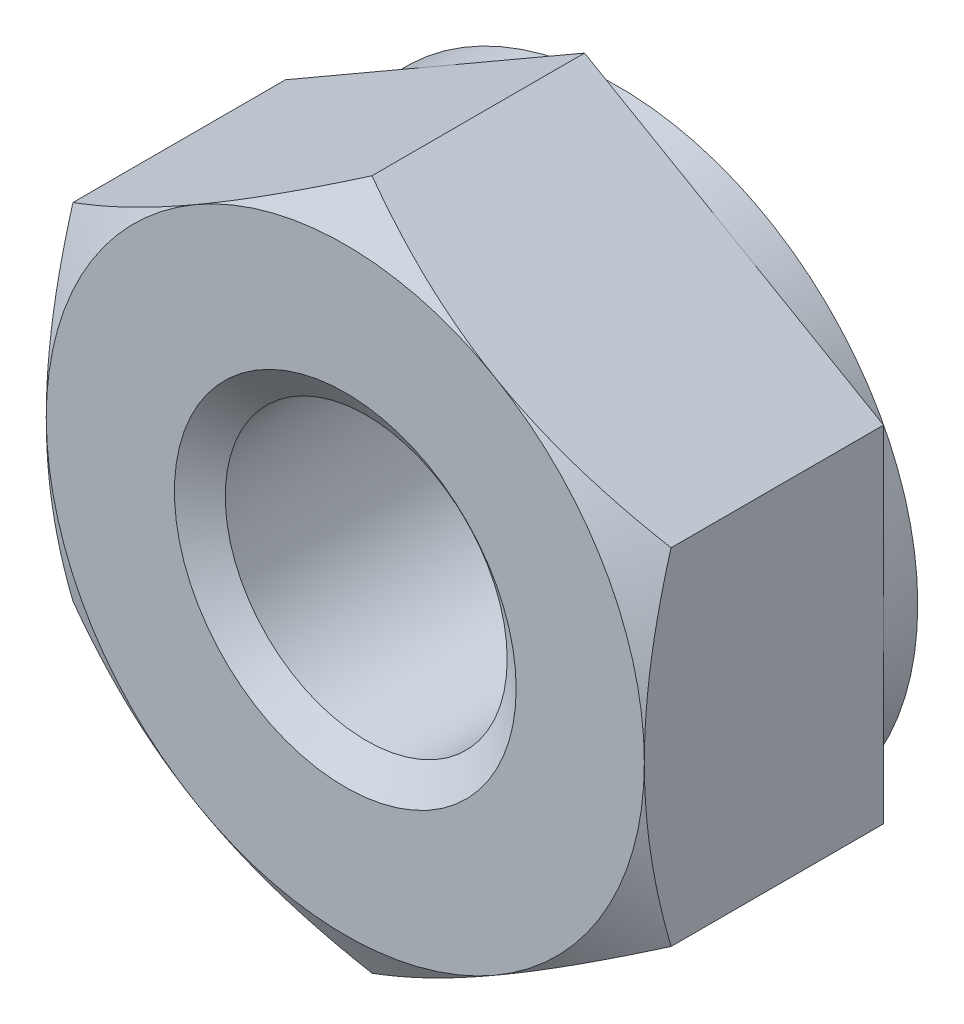
ISO-10303-21;
HEADER;
FILE_DESCRIPTION(('STEP AP214'),'2;1');
FILE_NAME('part.step','',(''),(''),'','','');
FILE_SCHEMA(('AUTOMOTIVE_DESIGN { 1 0 10303 214 1 1 1 1 }'));
ENDSEC;
DATA;
#1=APPLICATION_CONTEXT('core data for automotive mechanical design processes');
#2=APPLICATION_PROTOCOL_DEFINITION('international standard','automotive_design',2000,#1);
#3=PRODUCT_CONTEXT('',#1,'mechanical');
#4=PRODUCT('Part','Part','',(#3));
#5=PRODUCT_RELATED_PRODUCT_CATEGORY('part','',(#4));
#6=PRODUCT_DEFINITION_FORMATION('','',#4);
#7=PRODUCT_DEFINITION_CONTEXT('part definition',#1,'design');
#8=PRODUCT_DEFINITION('design','',#6,#7);
#9=PRODUCT_DEFINITION_SHAPE('','',#8);
#10=(LENGTH_UNIT() NAMED_UNIT(*) SI_UNIT(.MILLI.,.METRE.));
#11=(NAMED_UNIT(*) PLANE_ANGLE_UNIT() SI_UNIT($,.RADIAN.));
#12=(NAMED_UNIT(*) SI_UNIT($,.STERADIAN.) SOLID_ANGLE_UNIT());
#13=UNCERTAINTY_MEASURE_WITH_UNIT(LENGTH_MEASURE(1.E-05),#10,'distance_accuracy_value','');
#14=(GEOMETRIC_REPRESENTATION_CONTEXT(3) GLOBAL_UNCERTAINTY_ASSIGNED_CONTEXT((#13)) GLOBAL_UNIT_ASSIGNED_CONTEXT((#10,
#11,#12)) REPRESENTATION_CONTEXT('',''));
#15=CARTESIAN_POINT('',(0.,0.,0.));
#16=DIRECTION('',(0.,0.,1.));
#17=DIRECTION('',(1.,0.,0.));
#18=AXIS2_PLACEMENT_3D('',#15,#16,#17);
#19=CARTESIAN_POINT('',(0.,0.,-3.2));
#20=DIRECTION('',(0.,0.,1.));
#21=DIRECTION('',(1.,0.,0.));
#22=AXIS2_PLACEMENT_3D('',#19,#20,#21);
#23=CYLINDRICAL_SURFACE('',#22,1.65);
#24=CARTESIAN_POINT('',(0.,0.,-0.245072638373399));
#25=DIRECTION('',(0.,0.,1.));
#26=DIRECTION('',(1.,0.,0.));
#27=AXIS2_PLACEMENT_3D('',#24,#25,#26);
#28=CIRCLE('',#27,1.65);
#29=CARTESIAN_POINT('',(1.65,0.,-0.245072638373399));
#30=VERTEX_POINT('',#29);
#31=EDGE_CURVE('E153',#30,#30,#28,.F.);
#32=ORIENTED_EDGE('',*,*,#31,.F.);
#33=EDGE_LOOP('',(#32));
#34=FACE_BOUND('',#33,.T.);
#35=CARTESIAN_POINT('',(0.,0.,-2.9295273616266));
#36=DIRECTION('',(0.,0.,-1.));
#37=DIRECTION('',(-1.,0.,0.));
#38=AXIS2_PLACEMENT_3D('',#35,#36,#37);
#39=CIRCLE('',#38,1.65);
#40=CARTESIAN_POINT('',(-1.65,0.,-2.9295273616266));
#41=VERTEX_POINT('',#40);
#42=EDGE_CURVE('E41',#41,#41,#39,.F.);
#43=ORIENTED_EDGE('',*,*,#42,.F.);
#44=EDGE_LOOP('',(#43));
#45=FACE_BOUND('',#44,.T.);
#46=ADVANCED_FACE('F36',(#34,#45),#23,.F.);
#47=CARTESIAN_POINT('',(0.,4.04145188432738,-3.2));
#48=DIRECTION('',(-0.500000000000001,0.866025403784438,0.));
#49=DIRECTION('',(-0.866025403784438,-0.500000000000001,0.));
#50=AXIS2_PLACEMENT_3D('',#47,#48,#49);
#51=PLANE('',#50);
#52=DIRECTION('',(0.,0.,1.));
#53=VECTOR('',#52,1.);
#54=CARTESIAN_POINT('',(-3.5,2.02072594216369,-3.2));
#55=LINE('',#54,#53);
#56=CARTESIAN_POINT('',(-3.5,2.02072594216369,-2.8));
#57=VERTEX_POINT('',#56);
#58=CARTESIAN_POINT('',(-3.5,2.02072594216369,-0.312607391169646));
#59=VERTEX_POINT('',#58);
#60=EDGE_CURVE('E288',#57,#59,#55,.T.);
#61=ORIENTED_EDGE('',*,*,#60,.T.);
#62=CARTESIAN_POINT('',(-3.5002,2.02061047210985,-0.312674060693372));
#63=CARTESIAN_POINT('',(-3.34639282154755,2.10941108799267,-0.261385788989984));
#64=CARTESIAN_POINT('',(-3.19125798916558,2.19897822522909,-0.214740953816197));
#65=CARTESIAN_POINT('',(-2.87830199342322,2.37966345361545,-0.133321875533349));
#66=CARTESIAN_POINT('',(-2.7204752692125,2.47078475532382,-0.0985764355845612));
#67=CARTESIAN_POINT('',(-2.40677778961987,2.65189807961073,-0.0444900271828357));
#68=CARTESIAN_POINT('',(-2.25095530083931,2.74186223545399,-0.0247890862603812));
#69=CARTESIAN_POINT('',(-1.93857711279463,2.92221386641056,-0.00127013273725415));
#70=CARTESIAN_POINT('',(-1.78202254896577,3.01260068598001,0.00256735545443494));
#71=CARTESIAN_POINT('',(-1.48949078007901,3.1814939814933,-0.00541530187697763));
#72=CARTESIAN_POINT('',(-1.35346978754209,3.26002573814993,-0.0152754340696072));
#73=CARTESIAN_POINT('',(-1.08231397971101,3.41657761679354,-0.046526466899404));
#74=CARTESIAN_POINT('',(-0.947180102315317,3.49459719728458,-0.0679280432857989));
#75=CARTESIAN_POINT('',(-0.675465207594816,3.65147186489429,-0.121430407880578));
#76=CARTESIAN_POINT('',(-0.538918580721664,3.73030709667644,-0.153757994445088));
#77=CARTESIAN_POINT('',(-0.267861907055498,3.88680174018324,-0.227128933807996));
#78=CARTESIAN_POINT('',(-0.133348387531463,3.96446315689009,-0.268155046569869));
#79=CARTESIAN_POINT('',(0.000200000000000957,4.04156735438122,-0.312674060693374));
#80=B_SPLINE_CURVE_WITH_KNOTS('',3,(#62,#63,#64,#65,#66,#67,#68,#69,#70,#71,#72,#73,#74,#75,#76,
#77,#78,#79),.UNSPECIFIED.,.F.,.F.,(4,2,2,2,2,2,2,2,4),(0.,0.554793832886254,1.11092123814984,
1.65328467083219,2.19498204478403,2.6666513085086,3.13875761298267,3.6213361260051,
4.10296698719187),.UNSPECIFIED.);
#81=CARTESIAN_POINT('',(-1.75,3.03108891324553,0.));
#82=VERTEX_POINT('',#81);
#83=EDGE_CURVE('E60',#59,#82,#80,.T.);
#84=ORIENTED_EDGE('',*,*,#83,.T.);
#85=CARTESIAN_POINT('',(0.,4.04145188432738,-0.312607391169646));
#86=VERTEX_POINT('',#85);
#87=EDGE_CURVE('E167',#82,#86,#80,.T.);
#88=ORIENTED_EDGE('',*,*,#87,.T.);
#89=DIRECTION('',(0.,0.,1.));
#90=VECTOR('',#89,1.);
#91=CARTESIAN_POINT('',(0.,4.04145188432738,-3.2));
#92=LINE('',#91,#90);
#93=CARTESIAN_POINT('',(0.,4.04145188432738,-2.8));
#94=VERTEX_POINT('',#93);
#95=EDGE_CURVE('E276',#94,#86,#92,.T.);
#96=ORIENTED_EDGE('',*,*,#95,.F.);
#97=DIRECTION('',(-0.866025403784438,-0.500000000000001,0.));
#98=VECTOR('',#97,1.);
#99=CARTESIAN_POINT('',(0.,4.04145188432738,-2.8));
#100=LINE('',#99,#98);
#101=CARTESIAN_POINT('',(-1.75,3.03108891324553,-2.8));
#102=VERTEX_POINT('',#101);
#103=EDGE_CURVE('E264',#94,#102,#100,.T.);
#104=ORIENTED_EDGE('',*,*,#103,.T.);
#105=EDGE_CURVE('E260',#102,#57,#100,.T.);
#106=ORIENTED_EDGE('',*,*,#105,.T.);
#107=EDGE_LOOP('',(#61,#84,#88,#96,#104,#106));
#108=FACE_BOUND('',#107,.T.);
#109=ADVANCED_FACE('F38',(#108),#51,.T.);
#110=CARTESIAN_POINT('',(3.5,2.02072594216369,-3.2));
#111=DIRECTION('',(0.500000000000001,0.866025403784438,0.));
#112=DIRECTION('',(-0.866025403784438,0.500000000000001,0.));
#113=AXIS2_PLACEMENT_3D('',#110,#111,#112);
#114=PLANE('',#113);
#115=ORIENTED_EDGE('',*,*,#95,.T.);
#116=CARTESIAN_POINT('',(-0.000199999999999582,4.04156735438122,-0.312674060693374));
#117=CARTESIAN_POINT('',(0.15360717845245,3.9527667384984,-0.261385788989986));
#118=CARTESIAN_POINT('',(0.308742010834424,3.86319960126198,-0.214740953816199));
#119=CARTESIAN_POINT('',(0.621698006576782,3.68251437287562,-0.13332187553335));
#120=CARTESIAN_POINT('',(0.779524730787497,3.59139307116725,-0.0985764355845622));
#121=CARTESIAN_POINT('',(1.09322221038013,3.41027974688034,-0.0444900271828364));
#122=CARTESIAN_POINT('',(1.24904469916069,3.32031559103708,-0.0247890862603816));
#123=CARTESIAN_POINT('',(1.56142288720538,3.13996396008051,-0.00127013273725405));
#124=CARTESIAN_POINT('',(1.71797745103423,3.04957714051106,0.00256735545443515));
#125=CARTESIAN_POINT('',(2.01050921992099,2.88068384499777,-0.00541530187697721));
#126=CARTESIAN_POINT('',(2.14653021245791,2.80215208834114,-0.0152754340696066));
#127=CARTESIAN_POINT('',(2.417686020289,2.64560020969753,-0.0465264668994031));
#128=CARTESIAN_POINT('',(2.55281989768468,2.56758062920649,-0.0679280432857977));
#129=CARTESIAN_POINT('',(2.82453479240518,2.41070596159678,-0.121430407880577));
#130=CARTESIAN_POINT('',(2.96108141927834,2.33187072981463,-0.153757994445087));
#131=CARTESIAN_POINT('',(3.2321380929445,2.17537608630783,-0.227128933807994));
#132=CARTESIAN_POINT('',(3.36665161246854,2.09771466960098,-0.268155046569867));
#133=CARTESIAN_POINT('',(3.5002,2.02061047210985,-0.312674060693371));
#134=B_SPLINE_CURVE_WITH_KNOTS('',3,(#116,#117,#118,#119,#120,#121,#122,#123,#124,#125,#126,
#127,#128,#129,#130,#131,#132,#133),.UNSPECIFIED.,.F.,.F.,(4,2,2,2,2,2,2,2,4),(0.,
0.554793832886254,1.11092123814984,1.65328467083219,2.19498204478403,2.6666513085086,
3.13875761298267,3.6213361260051,4.10296698719187),.UNSPECIFIED.);
#135=CARTESIAN_POINT('',(1.75,3.03108891324553,0.));
#136=VERTEX_POINT('',#135);
#137=EDGE_CURVE('E164',#86,#136,#134,.T.);
#138=ORIENTED_EDGE('',*,*,#137,.T.);
#139=CARTESIAN_POINT('',(3.5,2.02072594216369,-0.312607391169646));
#140=VERTEX_POINT('',#139);
#141=EDGE_CURVE('E147',#136,#140,#134,.T.);
#142=ORIENTED_EDGE('',*,*,#141,.T.);
#143=DIRECTION('',(0.,0.,1.));
#144=VECTOR('',#143,1.);
#145=CARTESIAN_POINT('',(3.5,2.02072594216369,-3.2));
#146=LINE('',#145,#144);
#147=CARTESIAN_POINT('',(3.5,2.02072594216369,-2.8));
#148=VERTEX_POINT('',#147);
#149=EDGE_CURVE('E163',#148,#140,#146,.T.);
#150=ORIENTED_EDGE('',*,*,#149,.F.);
#151=DIRECTION('',(-0.866025403784438,0.500000000000001,0.));
#152=VECTOR('',#151,1.);
#153=CARTESIAN_POINT('',(3.5,2.02072594216369,-2.8));
#154=LINE('',#153,#152);
#155=CARTESIAN_POINT('',(1.75,3.03108891324553,-2.8));
#156=VERTEX_POINT('',#155);
#157=EDGE_CURVE('E272',#148,#156,#154,.T.);
#158=ORIENTED_EDGE('',*,*,#157,.T.);
#159=EDGE_CURVE('E268',#156,#94,#154,.T.);
#160=ORIENTED_EDGE('',*,*,#159,.T.);
#161=EDGE_LOOP('',(#115,#138,#142,#150,#158,#160));
#162=FACE_BOUND('',#161,.T.);
#163=ADVANCED_FACE('F236',(#162),#114,.T.);
#164=CARTESIAN_POINT('',(3.5,2.02072594216369,-3.2));
#165=DIRECTION('',(-1.,0.,0.));
#166=DIRECTION('',(0.,0.,1.));
#167=AXIS2_PLACEMENT_3D('',#164,#165,#166);
#168=PLANE('',#167);
#169=CARTESIAN_POINT('',(3.5,-5.35926299121406,-1.67484346858556));
#170=CARTESIAN_POINT('',(3.5,-5.20559319908842,-1.60058173692104));
#171=CARTESIAN_POINT('',(3.5,-5.05156008083376,-1.52705822833148));
#172=CARTESIAN_POINT('',(3.5,-4.7425707418071,-1.38190950344752));
#173=CARTESIAN_POINT('',(3.5,-4.58761436682437,-1.31028461582133));
#174=CARTESIAN_POINT('',(3.5,-4.27574500225542,-1.16897765517624));
#175=CARTESIAN_POINT('',(3.5,-4.11882589028192,-1.09930904568016));
#176=CARTESIAN_POINT('',(3.5,-3.80369792903856,-0.962964262242763));
#177=CARTESIAN_POINT('',(3.5,-3.64548914750596,-0.896287932319521));
#178=CARTESIAN_POINT('',(3.5,-3.32556618401855,-0.765931819095069));
#179=CARTESIAN_POINT('',(3.5,-3.16383281219924,-0.702298873688867));
#180=CARTESIAN_POINT('',(3.5,-2.83845840945598,-0.580016702089494));
#181=CARTESIAN_POINT('',(3.5,-2.67481716858826,-0.521368030370693));
#182=CARTESIAN_POINT('',(3.5,-2.34570278472049,-0.410630279877023));
#183=CARTESIAN_POINT('',(3.5,-2.18023438248743,-0.358527255435859));
#184=CARTESIAN_POINT('',(3.5,-1.8469452280637,-0.262572936976444));
#185=CARTESIAN_POINT('',(3.5,-1.6791252378753,-0.218719033467159));
#186=CARTESIAN_POINT('',(3.5,-1.34101828610925,-0.141391945584787));
#187=CARTESIAN_POINT('',(3.5,-1.17073068027693,-0.107921525211973));
#188=CARTESIAN_POINT('',(3.5,-0.828102385138485,-0.0536149564320507));
#189=CARTESIAN_POINT('',(3.5,-0.655761694017303,-0.0327788191952368));
#190=CARTESIAN_POINT('',(3.5,-0.31102049092445,-0.0055840865057568));
#191=CARTESIAN_POINT('',(3.5,-0.13862739720726,0.000866163165911258));
#192=CARTESIAN_POINT('',(3.5,0.206038074906535,-0.00105355807794609));
#193=CARTESIAN_POINT('',(3.5,0.378310473023179,-0.00941968196343193));
#194=CARTESIAN_POINT('',(3.5,0.672490555822326,-0.0357688927868922));
#195=CARTESIAN_POINT('',(3.5,0.794722791084091,-0.0503206340384215));
#196=CARTESIAN_POINT('',(3.5,1.0382430543056,-0.0859367340533558));
#197=CARTESIAN_POINT('',(3.5,1.15953093025886,-0.107002119926141));
#198=CARTESIAN_POINT('',(3.5,1.52187914771348,-0.178863187081452));
#199=CARTESIAN_POINT('',(3.5,1.76124104212632,-0.23830527562201));
#200=CARTESIAN_POINT('',(3.5,2.11940971387708,-0.340826814402554));
#201=CARTESIAN_POINT('',(3.5,2.24008344316346,-0.377749699085183));
#202=CARTESIAN_POINT('',(3.5,2.48017139213728,-0.455249007699293));
#203=CARTESIAN_POINT('',(3.5,2.59958641795613,-0.495822911663549));
#204=CARTESIAN_POINT('',(3.5,2.83665760451798,-0.579779986782752));
#205=CARTESIAN_POINT('',(3.5,2.95431988203483,-0.623146060034314));
#206=CARTESIAN_POINT('',(3.5,3.188731535088,-0.712423559566865));
#207=CARTESIAN_POINT('',(3.5,3.30548051959464,-0.758336014592949));
#208=CARTESIAN_POINT('',(3.5,3.42180736613348,-0.80527038072407));
#209=B_SPLINE_CURVE_WITH_KNOTS('',3,(#169,#170,#171,#172,#173,#174,#175,#176,#177,#178,#179,
#180,#181,#182,#183,#184,#185,#186,#187,#188,#189,#190,#191,#192,#193,#194,#195,#196,#197,#198,
#199,#200,#201,#202,#203,#204,#205,#206,#207,#208),.UNSPECIFIED.,.F.,.F.,(4,2,2,2,2,2,2,2,2,2,2,
2,2,2,2,2,2,2,2,4),(0.,0.512025318465737,1.02413870177436,1.53918270315241,2.05419982499223,
2.57553975872798,3.09693761309353,3.61720506610401,4.13730766217537,4.65754858684365,
5.17778997146961,5.69470725122282,6.21149033452401,6.58059623222331,6.94976036239485,
7.68863804939851,8.06719621660478,8.44549507476761,8.82166461280099,9.1979872473341),.UNSPECIFIED.);
#210=CARTESIAN_POINT('',(3.5,-2.0207259421637,-0.312607391169646));
#211=VERTEX_POINT('',#210);
#212=CARTESIAN_POINT('',(3.5,0.,0.));
#213=VERTEX_POINT('',#212);
#214=EDGE_CURVE('E128',#211,#213,#209,.T.);
#215=ORIENTED_EDGE('',*,*,#214,.F.);
#216=DIRECTION('',(0.,0.,1.));
#217=VECTOR('',#216,1.);
#218=CARTESIAN_POINT('',(3.5,-2.0207259421637,-3.2));
#219=LINE('',#218,#217);
#220=CARTESIAN_POINT('',(3.5,-2.0207259421637,-2.8));
#221=VERTEX_POINT('',#220);
#222=EDGE_CURVE('E281',#221,#211,#219,.T.);
#223=ORIENTED_EDGE('',*,*,#222,.F.);
#224=DIRECTION('',(0.,-1.,0.));
#225=VECTOR('',#224,1.);
#226=CARTESIAN_POINT('',(3.5,2.02072594216369,-2.8));
#227=LINE('',#226,#225);
#228=CARTESIAN_POINT('',(3.5,0.,-2.8));
#229=VERTEX_POINT('',#228);
#230=EDGE_CURVE('E273',#229,#221,#227,.T.);
#231=ORIENTED_EDGE('',*,*,#230,.F.);
#232=EDGE_CURVE('E275',#148,#229,#227,.T.);
#233=ORIENTED_EDGE('',*,*,#232,.F.);
#234=ORIENTED_EDGE('',*,*,#149,.T.);
#235=EDGE_CURVE('E141',#213,#140,#209,.T.);
#236=ORIENTED_EDGE('',*,*,#235,.F.);
#237=EDGE_LOOP('',(#215,#223,#231,#233,#234,#236));
#238=FACE_BOUND('',#237,.T.);
#239=ADVANCED_FACE('F160',(#238),#168,.F.);
#240=CARTESIAN_POINT('',(0.,-4.04145188432739,-3.2));
#241=DIRECTION('',(0.500000000000001,-0.866025403784438,0.));
#242=DIRECTION('',(0.866025403784438,0.500000000000001,0.));
#243=AXIS2_PLACEMENT_3D('',#240,#241,#242);
#244=PLANE('',#243);
#245=ORIENTED_EDGE('',*,*,#222,.T.);
#246=CARTESIAN_POINT('',(3.5002,-2.02061047210986,-0.312674060693374));
#247=CARTESIAN_POINT('',(3.34639282154755,-2.10941108799268,-0.261385788989986));
#248=CARTESIAN_POINT('',(3.19125798916558,-2.1989782252291,-0.214740953816199));
#249=CARTESIAN_POINT('',(2.87830199342322,-2.37966345361545,-0.133321875533351));
#250=CARTESIAN_POINT('',(2.7204752692125,-2.47078475532383,-0.0985764355845636));
#251=CARTESIAN_POINT('',(2.40677778961987,-2.65189807961074,-0.0444900271828383));
#252=CARTESIAN_POINT('',(2.25095530083931,-2.741862235454,-0.0247890862603838));
#253=CARTESIAN_POINT('',(1.93857711279462,-2.92221386641056,-0.00127013273725686));
#254=CARTESIAN_POINT('',(1.78202254896577,-3.01260068598002,0.00256735545443198));
#255=CARTESIAN_POINT('',(1.48949078007901,-3.18149398149331,-0.00541530187698112));
#256=CARTESIAN_POINT('',(1.35346978754209,-3.26002573814994,-0.0152754340696109));
#257=CARTESIAN_POINT('',(1.082313979711,-3.41657761679354,-0.0465264668994078));
#258=CARTESIAN_POINT('',(0.947180102315316,-3.49459719728458,-0.0679280432858026));
#259=CARTESIAN_POINT('',(0.675465207594815,-3.6514718648943,-0.121430407880582));
#260=CARTESIAN_POINT('',(0.538918580721663,-3.73030709667644,-0.153757994445092));
#261=CARTESIAN_POINT('',(0.267861907055497,-3.88680174018325,-0.227128933808));
#262=CARTESIAN_POINT('',(0.133348387531463,-3.9644631568901,-0.268155046569873));
#263=CARTESIAN_POINT('',(-0.000200000000000254,-4.04156735438123,-0.312674060693377));
#264=B_SPLINE_CURVE_WITH_KNOTS('',3,(#246,#247,#248,#249,#250,#251,#252,#253,#254,#255,#256,
#257,#258,#259,#260,#261,#262,#263),.UNSPECIFIED.,.F.,.F.,(4,2,2,2,2,2,2,2,4),(0.,
0.554793832886255,1.11092123814984,1.65328467083219,2.19498204478403,2.6666513085086,
3.13875761298268,3.6213361260051,4.10296698719187),.UNSPECIFIED.);
#265=CARTESIAN_POINT('',(1.75,-3.03108891324553,0.));
#266=VERTEX_POINT('',#265);
#267=EDGE_CURVE('E135',#211,#266,#264,.T.);
#268=ORIENTED_EDGE('',*,*,#267,.T.);
#269=CARTESIAN_POINT('',(0.,-4.04145188432738,-0.312607391169646));
#270=VERTEX_POINT('',#269);
#271=EDGE_CURVE('E174',#266,#270,#264,.T.);
#272=ORIENTED_EDGE('',*,*,#271,.T.);
#273=DIRECTION('',(0.,0.,1.));
#274=VECTOR('',#273,1.);
#275=CARTESIAN_POINT('',(0.,-4.04145188432739,-3.2));
#276=LINE('',#275,#274);
#277=CARTESIAN_POINT('',(0.,-4.04145188432739,-2.8));
#278=VERTEX_POINT('',#277);
#279=EDGE_CURVE('E283',#278,#270,#276,.T.);
#280=ORIENTED_EDGE('',*,*,#279,.F.);
#281=DIRECTION('',(0.866025403784438,0.500000000000001,0.));
#282=VECTOR('',#281,1.);
#283=CARTESIAN_POINT('',(0.,-4.04145188432739,-2.8));
#284=LINE('',#283,#282);
#285=CARTESIAN_POINT('',(1.75000000000001,-3.03108891324554,-2.8));
#286=VERTEX_POINT('',#285);
#287=EDGE_CURVE('E265',#278,#286,#284,.T.);
#288=ORIENTED_EDGE('',*,*,#287,.T.);
#289=EDGE_CURVE('E269',#286,#221,#284,.T.);
#290=ORIENTED_EDGE('',*,*,#289,.T.);
#291=EDGE_LOOP('',(#245,#268,#272,#280,#288,#290));
#292=FACE_BOUND('',#291,.T.);
#293=ADVANCED_FACE('F217',(#292),#244,.T.);
#294=CARTESIAN_POINT('',(-3.5,-2.02072594216369,-3.2));
#295=DIRECTION('',(-0.500000000000001,-0.866025403784438,0.));
#296=DIRECTION('',(0.866025403784438,-0.500000000000001,0.));
#297=AXIS2_PLACEMENT_3D('',#294,#295,#296);
#298=PLANE('',#297);
#299=ORIENTED_EDGE('',*,*,#279,.T.);
#300=CARTESIAN_POINT('',(0.000199999999999624,-4.04156735438123,-0.312674060693377));
#301=CARTESIAN_POINT('',(-0.15360717845245,-3.95276673849841,-0.261385788989989));
#302=CARTESIAN_POINT('',(-0.308742010834425,-3.86319960126199,-0.214740953816202));
#303=CARTESIAN_POINT('',(-0.621698006576783,-3.68251437287563,-0.133321875533353));
#304=CARTESIAN_POINT('',(-0.779524730787498,-3.59139307116726,-0.0985764355845654));
#305=CARTESIAN_POINT('',(-1.09322221038013,-3.41027974688034,-0.0444900271828395));
#306=CARTESIAN_POINT('',(-1.24904469916069,-3.32031559103708,-0.0247890862603848));
#307=CARTESIAN_POINT('',(-1.56142288720538,-3.13996396008052,-0.00127013273725731));
#308=CARTESIAN_POINT('',(-1.71797745103423,-3.04957714051106,0.00256735545443195));
#309=CARTESIAN_POINT('',(-2.01050921992099,-2.88068384499778,-0.0054153018769805));
#310=CARTESIAN_POINT('',(-2.14653021245791,-2.80215208834115,-0.01527543406961));
#311=CARTESIAN_POINT('',(-2.417686020289,-2.64560020969754,-0.0465264668994063));
#312=CARTESIAN_POINT('',(-2.55281989768469,-2.5675806292065,-0.0679280432858008));
#313=CARTESIAN_POINT('',(-2.82453479240519,-2.41070596159679,-0.121430407880579));
#314=CARTESIAN_POINT('',(-2.96108141927834,-2.33187072981464,-0.153757994445089));
#315=CARTESIAN_POINT('',(-3.2321380929445,-2.17537608630783,-0.227128933807996));
#316=CARTESIAN_POINT('',(-3.36665161246854,-2.09771466960099,-0.268155046569869));
#317=CARTESIAN_POINT('',(-3.5002,-2.02061047210986,-0.312674060693373));
#318=B_SPLINE_CURVE_WITH_KNOTS('',3,(#300,#301,#302,#303,#304,#305,#306,#307,#308,#309,#310,
#311,#312,#313,#314,#315,#316,#317),.UNSPECIFIED.,.F.,.F.,(4,2,2,2,2,2,2,2,4),(0.,
0.554793832886255,1.11092123814984,1.65328467083219,2.19498204478404,2.6666513085086,
3.13875761298268,3.6213361260051,4.10296698719187),.UNSPECIFIED.);
#319=CARTESIAN_POINT('',(-1.75,-3.03108891324553,0.));
#320=VERTEX_POINT('',#319);
#321=EDGE_CURVE('E211',#270,#320,#318,.T.);
#322=ORIENTED_EDGE('',*,*,#321,.T.);
#323=CARTESIAN_POINT('',(-3.5,-2.02072594216369,-0.312607391169646));
#324=VERTEX_POINT('',#323);
#325=EDGE_CURVE('E204',#320,#324,#318,.T.);
#326=ORIENTED_EDGE('',*,*,#325,.T.);
#327=DIRECTION('',(0.,0.,1.));
#328=VECTOR('',#327,1.);
#329=CARTESIAN_POINT('',(-3.5,-2.02072594216369,-3.2));
#330=LINE('',#329,#328);
#331=CARTESIAN_POINT('',(-3.5,-2.02072594216369,-2.8));
#332=VERTEX_POINT('',#331);
#333=EDGE_CURVE('E286',#332,#324,#330,.T.);
#334=ORIENTED_EDGE('',*,*,#333,.F.);
#335=DIRECTION('',(0.866025403784438,-0.500000000000001,0.));
#336=VECTOR('',#335,1.);
#337=CARTESIAN_POINT('',(-3.5,-2.02072594216369,-2.8));
#338=LINE('',#337,#336);
#339=CARTESIAN_POINT('',(-1.75000000000001,-3.03108891324554,-2.8));
#340=VERTEX_POINT('',#339);
#341=EDGE_CURVE('E255',#332,#340,#338,.T.);
#342=ORIENTED_EDGE('',*,*,#341,.T.);
#343=EDGE_CURVE('E261',#340,#278,#338,.T.);
#344=ORIENTED_EDGE('',*,*,#343,.T.);
#345=EDGE_LOOP('',(#299,#322,#326,#334,#342,#344));
#346=FACE_BOUND('',#345,.T.);
#347=ADVANCED_FACE('F213',(#346),#298,.T.);
#348=CARTESIAN_POINT('',(-3.5,2.02072594216369,-3.2));
#349=DIRECTION('',(-1.,0.,0.));
#350=DIRECTION('',(0.,0.,1.));
#351=AXIS2_PLACEMENT_3D('',#348,#349,#350);
#352=PLANE('',#351);
#353=ORIENTED_EDGE('',*,*,#333,.T.);
#354=CARTESIAN_POINT('',(-3.5,-5.35926299121406,-1.67484346858556));
#355=CARTESIAN_POINT('',(-3.5,-5.20559319908842,-1.60058173692104));
#356=CARTESIAN_POINT('',(-3.5,-5.05156008083375,-1.52705822833148));
#357=CARTESIAN_POINT('',(-3.5,-4.7425707418071,-1.38190950344752));
#358=CARTESIAN_POINT('',(-3.5,-4.58761436682437,-1.31028461582133));
#359=CARTESIAN_POINT('',(-3.5,-4.27574500225542,-1.16897765517624));
#360=CARTESIAN_POINT('',(-3.5,-4.11882589028192,-1.09930904568016));
#361=CARTESIAN_POINT('',(-3.5,-3.80369792903855,-0.962964262242763));
#362=CARTESIAN_POINT('',(-3.5,-3.64548914750595,-0.89628793231952));
#363=CARTESIAN_POINT('',(-3.5,-3.32556618401855,-0.765931819095068));
#364=CARTESIAN_POINT('',(-3.5,-3.16383281219924,-0.702298873688866));
#365=CARTESIAN_POINT('',(-3.5,-2.83845840945597,-0.580016702089493));
#366=CARTESIAN_POINT('',(-3.5,-2.67481716858826,-0.521368030370692));
#367=CARTESIAN_POINT('',(-3.5,-2.34570278472049,-0.410630279877022));
#368=CARTESIAN_POINT('',(-3.5,-2.18023438248742,-0.358527255435858));
#369=CARTESIAN_POINT('',(-3.5,-1.8469452280637,-0.262572936976443));
#370=CARTESIAN_POINT('',(-3.5,-1.6791252378753,-0.218719033467158));
#371=CARTESIAN_POINT('',(-3.5,-1.34101828610925,-0.141391945584787));
#372=CARTESIAN_POINT('',(-3.5,-1.17073068027693,-0.107921525211973));
#373=CARTESIAN_POINT('',(-3.5,-0.828102385138484,-0.0536149564320504));
#374=CARTESIAN_POINT('',(-3.5,-0.655761694017301,-0.0327788191952365));
#375=CARTESIAN_POINT('',(-3.5,-0.311020490924449,-0.00558408650575661));
#376=CARTESIAN_POINT('',(-3.5,-0.138627397207259,0.00086616316591139));
#377=CARTESIAN_POINT('',(-3.5,0.206038074906536,-0.00105355807794622));
#378=CARTESIAN_POINT('',(-3.5,0.37831047302318,-0.00941968196343225));
#379=CARTESIAN_POINT('',(-3.5,0.672490555822327,-0.0357688927868924));
#380=CARTESIAN_POINT('',(-3.5,0.794722791084092,-0.0503206340384215));
#381=CARTESIAN_POINT('',(-3.5,1.0382430543056,-0.0859367340533558));
#382=CARTESIAN_POINT('',(-3.5,1.15953093025887,-0.107002119926141));
#383=CARTESIAN_POINT('',(-3.5,1.52187914771348,-0.178863187081453));
#384=CARTESIAN_POINT('',(-3.5,1.76124104212632,-0.23830527562201));
#385=CARTESIAN_POINT('',(-3.5,2.11940971387708,-0.340826814402554));
#386=CARTESIAN_POINT('',(-3.5,2.24008344316346,-0.377749699085183));
#387=CARTESIAN_POINT('',(-3.5,2.48017139213728,-0.455249007699293));
#388=CARTESIAN_POINT('',(-3.5,2.59958641795613,-0.49582291166355));
#389=CARTESIAN_POINT('',(-3.5,2.83665760451798,-0.579779986782752));
#390=CARTESIAN_POINT('',(-3.5,2.95431988203483,-0.623146060034314));
#391=CARTESIAN_POINT('',(-3.5,3.188731535088,-0.712423559566866));
#392=CARTESIAN_POINT('',(-3.5,3.30548051959464,-0.75833601459295));
#393=CARTESIAN_POINT('',(-3.5,3.42180736613349,-0.805270380724071));
#394=B_SPLINE_CURVE_WITH_KNOTS('',3,(#354,#355,#356,#357,#358,#359,#360,#361,#362,#363,#364,
#365,#366,#367,#368,#369,#370,#371,#372,#373,#374,#375,#376,#377,#378,#379,#380,#381,#382,#383,
#384,#385,#386,#387,#388,#389,#390,#391,#392,#393),.UNSPECIFIED.,.F.,.F.,(4,2,2,2,2,2,2,2,2,2,2,
2,2,2,2,2,2,2,2,4),(0.,0.512025318465737,1.02413870177436,1.53918270315241,2.05419982499223,
2.57553975872798,3.09693761309353,3.61720506610401,4.13730766217537,4.65754858684365,
5.17778997146961,5.69470725122282,6.21149033452401,6.58059623222331,6.94976036239485,
7.68863804939851,8.06719621660478,8.4454950747676,8.82166461280099,9.1979872473341),.UNSPECIFIED.);
#395=CARTESIAN_POINT('',(-3.5,0.,0.));
#396=VERTEX_POINT('',#395);
#397=EDGE_CURVE('E212',#324,#396,#394,.T.);
#398=ORIENTED_EDGE('',*,*,#397,.T.);
#399=EDGE_CURVE('E152',#396,#59,#394,.T.);
#400=ORIENTED_EDGE('',*,*,#399,.T.);
#401=ORIENTED_EDGE('',*,*,#60,.F.);
#402=DIRECTION('',(0.,-1.,0.));
#403=VECTOR('',#402,1.);
#404=CARTESIAN_POINT('',(-3.5,2.02072594216369,-2.8));
#405=LINE('',#404,#403);
#406=CARTESIAN_POINT('',(-3.5,0.,-2.8));
#407=VERTEX_POINT('',#406);
#408=EDGE_CURVE('E295',#57,#407,#405,.T.);
#409=ORIENTED_EDGE('',*,*,#408,.T.);
#410=EDGE_CURVE('E293',#407,#332,#405,.T.);
#411=ORIENTED_EDGE('',*,*,#410,.T.);
#412=EDGE_LOOP('',(#353,#398,#400,#401,#409,#411));
#413=FACE_BOUND('',#412,.T.);
#414=ADVANCED_FACE('F216',(#413),#352,.T.);
#415=CARTESIAN_POINT('',(0.,4.04145188432738,0.));
#416=DIRECTION('',(0.,0.,-1.));
#417=DIRECTION('',(-1.,0.,0.));
#418=AXIS2_PLACEMENT_3D('',#415,#416,#417);
#419=PLANE('',#418);
#420=CARTESIAN_POINT('',(0.,0.,0.));
#421=DIRECTION('',(0.,0.,1.));
#422=DIRECTION('',(1.,0.,0.));
#423=AXIS2_PLACEMENT_3D('',#420,#421,#422);
#424=CIRCLE('',#423,2.);
#425=CARTESIAN_POINT('',(2.,0.,0.));
#426=VERTEX_POINT('',#425);
#427=EDGE_CURVE('E298',#426,#426,#424,.T.);
#428=ORIENTED_EDGE('',*,*,#427,.F.);
#429=EDGE_LOOP('',(#428));
#430=FACE_BOUND('',#429,.T.);
#431=CARTESIAN_POINT('',(0.,0.,0.));
#432=DIRECTION('',(0.,0.,-1.));
#433=DIRECTION('',(-1.,0.,0.));
#434=AXIS2_PLACEMENT_3D('',#431,#432,#433);
#435=CIRCLE('',#434,3.5);
#436=EDGE_CURVE('E48',#82,#396,#435,.F.);
#437=ORIENTED_EDGE('',*,*,#436,.T.);
#438=EDGE_CURVE('E12',#396,#320,#435,.F.);
#439=ORIENTED_EDGE('',*,*,#438,.T.);
#440=EDGE_CURVE('E46',#320,#266,#435,.F.);
#441=ORIENTED_EDGE('',*,*,#440,.T.);
#442=EDGE_CURVE('E132',#266,#213,#435,.F.);
#443=ORIENTED_EDGE('',*,*,#442,.T.);
#444=CARTESIAN_POINT('',(0.,0.,0.));
#445=DIRECTION('',(0.,0.,1.));
#446=DIRECTION('',(1.,0.,0.));
#447=AXIS2_PLACEMENT_3D('',#444,#445,#446);
#448=CIRCLE('',#447,3.5);
#449=EDGE_CURVE('E144',#213,#136,#448,.T.);
#450=ORIENTED_EDGE('',*,*,#449,.T.);
#451=EDGE_CURVE('E158',#136,#82,#435,.F.);
#452=ORIENTED_EDGE('',*,*,#451,.T.);
#453=EDGE_LOOP('',(#437,#439,#441,#443,#450,#452));
#454=FACE_BOUND('',#453,.T.);
#455=ADVANCED_FACE('F156',(#430,#454),#419,.F.);
#456=CARTESIAN_POINT('',(0.,4.04145188432738,-3.2));
#457=DIRECTION('',(0.,0.,-1.));
#458=DIRECTION('',(-1.,0.,0.));
#459=AXIS2_PLACEMENT_3D('',#456,#457,#458);
#460=PLANE('',#459);
#461=CARTESIAN_POINT('',(0.,0.,-3.2));
#462=DIRECTION('',(0.,0.,-1.));
#463=DIRECTION('',(-1.,0.,0.));
#464=AXIS2_PLACEMENT_3D('',#461,#462,#463);
#465=CIRCLE('',#464,2.);
#466=CARTESIAN_POINT('',(-2.,0.,-3.2));
#467=VERTEX_POINT('',#466);
#468=EDGE_CURVE('E299',#467,#467,#465,.F.);
#469=ORIENTED_EDGE('',*,*,#468,.T.);
#470=EDGE_LOOP('',(#469));
#471=FACE_BOUND('',#470,.T.);
#472=CARTESIAN_POINT('',(0.,0.,-3.2));
#473=DIRECTION('',(0.,0.,-1.));
#474=DIRECTION('',(-1.,0.,0.));
#475=AXIS2_PLACEMENT_3D('',#472,#473,#474);
#476=CIRCLE('',#475,3.5);
#477=CARTESIAN_POINT('',(-3.5,0.,-3.2));
#478=VERTEX_POINT('',#477);
#479=EDGE_CURVE('E279',#478,#478,#476,.F.);
#480=ORIENTED_EDGE('',*,*,#479,.F.);
#481=EDGE_LOOP('',(#480));
#482=FACE_BOUND('',#481,.T.);
#483=ADVANCED_FACE('F226',(#471,#482),#460,.T.);
#484=CARTESIAN_POINT('',(0.,14.0414518843274,-2.8));
#485=DIRECTION('',(0.,0.,-1.));
#486=DIRECTION('',(-1.,0.,0.));
#487=AXIS2_PLACEMENT_3D('',#484,#485,#486);
#488=PLANE('',#487);
#489=ORIENTED_EDGE('',*,*,#232,.T.);
#490=CARTESIAN_POINT('',(0.,0.,-2.8));
#491=DIRECTION('',(0.,0.,1.));
#492=DIRECTION('',(1.,0.,0.));
#493=AXIS2_PLACEMENT_3D('',#490,#491,#492);
#494=CIRCLE('',#493,3.5);
#495=EDGE_CURVE('E252',#229,#156,#494,.T.);
#496=ORIENTED_EDGE('',*,*,#495,.T.);
#497=ORIENTED_EDGE('',*,*,#157,.F.);
#498=EDGE_LOOP('',(#489,#496,#497));
#499=FACE_BOUND('',#498,.T.);
#500=ADVANCED_FACE('F243',(#499),#488,.T.);
#501=ORIENTED_EDGE('',*,*,#230,.T.);
#502=ORIENTED_EDGE('',*,*,#289,.F.);
#503=EDGE_CURVE('E257',#286,#229,#494,.T.);
#504=ORIENTED_EDGE('',*,*,#503,.T.);
#505=EDGE_LOOP('',(#501,#502,#504));
#506=FACE_BOUND('',#505,.T.);
#507=ADVANCED_FACE('F445',(#506),#488,.T.);
#508=EDGE_CURVE('E256',#156,#102,#494,.T.);
#509=ORIENTED_EDGE('',*,*,#508,.T.);
#510=ORIENTED_EDGE('',*,*,#103,.F.);
#511=ORIENTED_EDGE('',*,*,#159,.F.);
#512=EDGE_LOOP('',(#509,#510,#511));
#513=FACE_BOUND('',#512,.T.);
#514=ADVANCED_FACE('F436',(#513),#488,.T.);
#515=ORIENTED_EDGE('',*,*,#343,.F.);
#516=EDGE_CURVE('E509',#340,#286,#494,.T.);
#517=ORIENTED_EDGE('',*,*,#516,.T.);
#518=ORIENTED_EDGE('',*,*,#287,.F.);
#519=EDGE_LOOP('',(#515,#517,#518));
#520=FACE_BOUND('',#519,.T.);
#521=ADVANCED_FACE('F427',(#520),#488,.T.);
#522=EDGE_CURVE('E523',#102,#407,#494,.T.);
#523=ORIENTED_EDGE('',*,*,#522,.T.);
#524=ORIENTED_EDGE('',*,*,#408,.F.);
#525=ORIENTED_EDGE('',*,*,#105,.F.);
#526=EDGE_LOOP('',(#523,#524,#525));
#527=FACE_BOUND('',#526,.T.);
#528=ADVANCED_FACE('F411',(#527),#488,.T.);
#529=CARTESIAN_POINT('',(0.,0.,0.));
#530=DIRECTION('',(0.,0.,1.));
#531=DIRECTION('',(1.,0.,0.));
#532=AXIS2_PLACEMENT_3D('',#529,#530,#531);
#533=CYLINDRICAL_SURFACE('',#532,3.5);
#534=ORIENTED_EDGE('',*,*,#479,.T.);
#535=EDGE_LOOP('',(#534));
#536=FACE_BOUND('',#535,.T.);
#537=ORIENTED_EDGE('',*,*,#508,.F.);
#538=ORIENTED_EDGE('',*,*,#495,.F.);
#539=ORIENTED_EDGE('',*,*,#503,.F.);
#540=ORIENTED_EDGE('',*,*,#516,.F.);
#541=EDGE_CURVE('E525',#407,#340,#494,.T.);
#542=ORIENTED_EDGE('',*,*,#541,.F.);
#543=ORIENTED_EDGE('',*,*,#522,.F.);
#544=EDGE_LOOP('',(#537,#538,#539,#540,#542,#543));
#545=FACE_BOUND('',#544,.T.);
#546=ADVANCED_FACE('F241',(#536,#545),#533,.T.);
#547=ORIENTED_EDGE('',*,*,#410,.F.);
#548=ORIENTED_EDGE('',*,*,#541,.T.);
#549=ORIENTED_EDGE('',*,*,#341,.F.);
#550=EDGE_LOOP('',(#547,#548,#549));
#551=FACE_BOUND('',#550,.T.);
#552=ADVANCED_FACE('F194',(#551),#488,.T.);
#553=CARTESIAN_POINT('',(0.,0.,0.));
#554=DIRECTION('',(0.,0.,-1.));
#555=DIRECTION('',(-1.,0.,0.));
#556=AXIS2_PLACEMENT_3D('',#553,#554,#555);
#557=CONICAL_SURFACE('',#556,3.5,1.0471975511966);
#558=ORIENTED_EDGE('',*,*,#399,.F.);
#559=ORIENTED_EDGE('',*,*,#436,.F.);
#560=ORIENTED_EDGE('',*,*,#83,.F.);
#561=EDGE_LOOP('',(#558,#559,#560));
#562=FACE_BOUND('',#561,.T.);
#563=ADVANCED_FACE('F373',(#562),#557,.T.);
#564=ORIENTED_EDGE('',*,*,#451,.F.);
#565=ORIENTED_EDGE('',*,*,#137,.F.);
#566=ORIENTED_EDGE('',*,*,#87,.F.);
#567=EDGE_LOOP('',(#564,#565,#566));
#568=FACE_BOUND('',#567,.T.);
#569=ADVANCED_FACE('F192',(#568),#557,.T.);
#570=ORIENTED_EDGE('',*,*,#449,.F.);
#571=ORIENTED_EDGE('',*,*,#235,.T.);
#572=ORIENTED_EDGE('',*,*,#141,.F.);
#573=EDGE_LOOP('',(#570,#571,#572));
#574=FACE_BOUND('',#573,.T.);
#575=ADVANCED_FACE('F145',(#574),#557,.T.);
#576=ORIENTED_EDGE('',*,*,#214,.T.);
#577=ORIENTED_EDGE('',*,*,#442,.F.);
#578=ORIENTED_EDGE('',*,*,#267,.F.);
#579=EDGE_LOOP('',(#576,#577,#578));
#580=FACE_BOUND('',#579,.T.);
#581=ADVANCED_FACE('F130',(#580),#557,.T.);
#582=ORIENTED_EDGE('',*,*,#440,.F.);
#583=ORIENTED_EDGE('',*,*,#321,.F.);
#584=ORIENTED_EDGE('',*,*,#271,.F.);
#585=EDGE_LOOP('',(#582,#583,#584));
#586=FACE_BOUND('',#585,.T.);
#587=ADVANCED_FACE('F191',(#586),#557,.T.);
#588=ORIENTED_EDGE('',*,*,#438,.F.);
#589=ORIENTED_EDGE('',*,*,#397,.F.);
#590=ORIENTED_EDGE('',*,*,#325,.F.);
#591=EDGE_LOOP('',(#588,#589,#590));
#592=FACE_BOUND('',#591,.T.);
#593=ADVANCED_FACE('F185',(#592),#557,.T.);
#594=CARTESIAN_POINT('',(0.,0.,-0.269579902210739));
#595=DIRECTION('',(0.,0.,1.));
#596=DIRECTION('',(1.,0.,0.));
#597=AXIS2_PLACEMENT_3D('',#594,#595,#596);
#598=CONICAL_SURFACE('',#597,1.615,0.95993108859688);
#599=ORIENTED_EDGE('',*,*,#427,.T.);
#600=EDGE_LOOP('',(#599));
#601=FACE_BOUND('',#600,.T.);
#602=ORIENTED_EDGE('',*,*,#31,.T.);
#603=EDGE_LOOP('',(#602));
#604=FACE_BOUND('',#603,.T.);
#605=ADVANCED_FACE('F190',(#601,#604),#598,.F.);
#606=CARTESIAN_POINT('',(0.,0.,-3.1746));
#607=DIRECTION('',(0.,0.,-1.));
#608=DIRECTION('',(-1.,0.,0.));
#609=AXIS2_PLACEMENT_3D('',#606,#607,#608);
#610=CONICAL_SURFACE('',#609,2.,0.95993108859688);
#611=CARTESIAN_POINT('',(0.,0.,-3.1746));
#612=DIRECTION('',(0.,0.,1.));
#613=DIRECTION('',(1.,0.,0.));
#614=AXIS2_PLACEMENT_3D('',#611,#612,#613);
#615=CIRCLE('',#614,2.);
#616=CARTESIAN_POINT('',(2.,0.,-3.1746));
#617=VERTEX_POINT('',#616);
#618=EDGE_CURVE('E301',#617,#617,#615,.T.);
#619=ORIENTED_EDGE('',*,*,#618,.F.);
#620=EDGE_LOOP('',(#619));
#621=FACE_BOUND('',#620,.T.);
#622=ORIENTED_EDGE('',*,*,#42,.T.);
#623=EDGE_LOOP('',(#622));
#624=FACE_BOUND('',#623,.T.);
#625=ADVANCED_FACE('F314',(#621,#624),#610,.F.);
#626=CARTESIAN_POINT('',(0.,0.,-25.0375057290932));
#627=DIRECTION('',(0.,0.,1.));
#628=DIRECTION('',(1.,0.,0.));
#629=AXIS2_PLACEMENT_3D('',#626,#627,#628);
#630=CYLINDRICAL_SURFACE('',#629,2.);
#631=ORIENTED_EDGE('',*,*,#468,.F.);
#632=EDGE_LOOP('',(#631));
#633=FACE_BOUND('',#632,.T.);
#634=ORIENTED_EDGE('',*,*,#618,.T.);
#635=EDGE_LOOP('',(#634));
#636=FACE_BOUND('',#635,.T.);
#637=ADVANCED_FACE('F318',(#633,#636),#630,.F.);
#638=CLOSED_SHELL('',(#46,#109,#163,#239,#293,#347,#414,#455,#483,#500,#507,#514,#521,#528,#546,
#552,#563,#569,#575,#581,#587,#593,#605,#625,#637));
#639=MANIFOLD_SOLID_BREP('B2',#638);
#640=ADVANCED_BREP_SHAPE_REPRESENTATION('',(#18,#639),#14);
#641=SHAPE_DEFINITION_REPRESENTATION(#9,#640);
ENDSEC;
END-ISO-10303-21;
